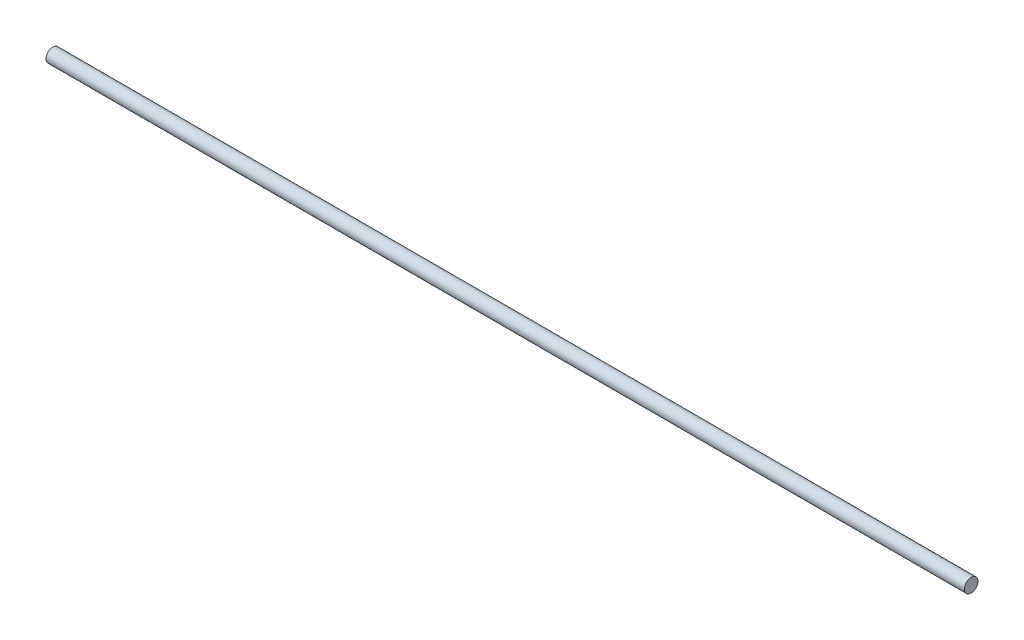
ISO-10303-21;
HEADER;
FILE_DESCRIPTION(('STEP AP214'),'2;1');
FILE_NAME('part.step','',(''),(''),'','','');
FILE_SCHEMA(('AUTOMOTIVE_DESIGN { 1 0 10303 214 1 1 1 1 }'));
ENDSEC;
DATA;
#1=APPLICATION_CONTEXT('core data for automotive mechanical design processes');
#2=APPLICATION_PROTOCOL_DEFINITION('international standard','automotive_design',2000,#1);
#3=PRODUCT_CONTEXT('',#1,'mechanical');
#4=PRODUCT('Part','Part','',(#3));
#5=PRODUCT_RELATED_PRODUCT_CATEGORY('part','',(#4));
#6=PRODUCT_DEFINITION_FORMATION('','',#4);
#7=PRODUCT_DEFINITION_CONTEXT('part definition',#1,'design');
#8=PRODUCT_DEFINITION('design','',#6,#7);
#9=PRODUCT_DEFINITION_SHAPE('','',#8);
#10=(LENGTH_UNIT() NAMED_UNIT(*) SI_UNIT(.MILLI.,.METRE.));
#11=(NAMED_UNIT(*) PLANE_ANGLE_UNIT() SI_UNIT($,.RADIAN.));
#12=(NAMED_UNIT(*) SI_UNIT($,.STERADIAN.) SOLID_ANGLE_UNIT());
#13=UNCERTAINTY_MEASURE_WITH_UNIT(LENGTH_MEASURE(1.E-05),#10,'distance_accuracy_value','');
#14=(GEOMETRIC_REPRESENTATION_CONTEXT(3) GLOBAL_UNCERTAINTY_ASSIGNED_CONTEXT((#13)) GLOBAL_UNIT_ASSIGNED_CONTEXT((#10,
#11,#12)) REPRESENTATION_CONTEXT('',''));
#15=CARTESIAN_POINT('',(0.,0.,0.));
#16=DIRECTION('',(0.,0.,1.));
#17=DIRECTION('',(1.,0.,0.));
#18=AXIS2_PLACEMENT_3D('',#15,#16,#17);
#19=CARTESIAN_POINT('',(-279.96942451487,9.74340095637069,0.));
#20=DIRECTION('',(1.,0.,0.));
#21=DIRECTION('',(0.,0.,-1.));
#22=AXIS2_PLACEMENT_3D('',#19,#20,#21);
#23=CYLINDRICAL_SURFACE('',#22,2.);
#24=CARTESIAN_POINT('',(-279.96942451487,9.74340095637069,0.));
#25=DIRECTION('',(1.,0.,0.));
#26=DIRECTION('',(0.,0.,-1.));
#27=AXIS2_PLACEMENT_3D('',#24,#25,#26);
#28=CIRCLE('',#27,2.);
#29=CARTESIAN_POINT('',(-279.96942451487,9.74340095637069,-2.));
#30=VERTEX_POINT('',#29);
#31=EDGE_CURVE('E10',#30,#30,#28,.T.);
#32=ORIENTED_EDGE('',*,*,#31,.T.);
#33=EDGE_LOOP('',(#32));
#34=FACE_BOUND('',#33,.T.);
#35=CARTESIAN_POINT('',(-9.32842451486985,9.74340095637069,0.));
#36=DIRECTION('',(1.,0.,0.));
#37=DIRECTION('',(0.,0.,-1.));
#38=AXIS2_PLACEMENT_3D('',#35,#36,#37);
#39=CIRCLE('',#38,2.);
#40=CARTESIAN_POINT('',(-9.32842451486985,9.74340095637069,-2.));
#41=VERTEX_POINT('',#40);
#42=EDGE_CURVE('E34',#41,#41,#39,.T.);
#43=ORIENTED_EDGE('',*,*,#42,.F.);
#44=EDGE_LOOP('',(#43));
#45=FACE_BOUND('',#44,.T.);
#46=ADVANCED_FACE('F31',(#34,#45),#23,.T.);
#47=CARTESIAN_POINT('',(-279.96942451487,9.74340095637069,0.));
#48=DIRECTION('',(1.,0.,0.));
#49=DIRECTION('',(0.,0.,-1.));
#50=AXIS2_PLACEMENT_3D('',#47,#48,#49);
#51=PLANE('',#50);
#52=ORIENTED_EDGE('',*,*,#31,.F.);
#53=EDGE_LOOP('',(#52));
#54=FACE_BOUND('',#53,.T.);
#55=ADVANCED_FACE('F46',(#54),#51,.F.);
#56=CARTESIAN_POINT('',(-9.32842451486985,9.74340095637069,0.));
#57=DIRECTION('',(1.,0.,0.));
#58=DIRECTION('',(0.,0.,-1.));
#59=AXIS2_PLACEMENT_3D('',#56,#57,#58);
#60=PLANE('',#59);
#61=ORIENTED_EDGE('',*,*,#42,.T.);
#62=EDGE_LOOP('',(#61));
#63=FACE_BOUND('',#62,.T.);
#64=ADVANCED_FACE('F43',(#63),#60,.T.);
#65=CLOSED_SHELL('',(#46,#55,#64));
#66=MANIFOLD_SOLID_BREP('B2',#65);
#67=ADVANCED_BREP_SHAPE_REPRESENTATION('',(#18,#66),#14);
#68=SHAPE_DEFINITION_REPRESENTATION(#9,#67);
ENDSEC;
END-ISO-10303-21;
